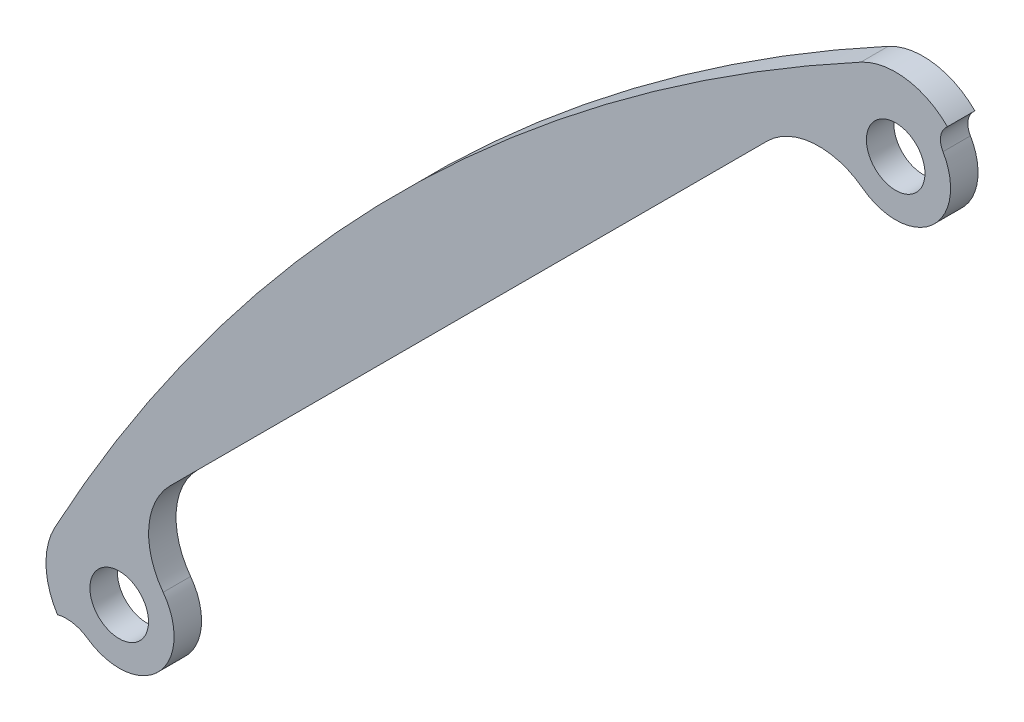
ISO-10303-21;
HEADER;
FILE_DESCRIPTION(('STEP AP214'),'2;1');
FILE_NAME('part.step','',(''),(''),'','','');
FILE_SCHEMA(('AUTOMOTIVE_DESIGN { 1 0 10303 214 1 1 1 1 }'));
ENDSEC;
DATA;
#1=APPLICATION_CONTEXT('core data for automotive mechanical design processes');
#2=APPLICATION_PROTOCOL_DEFINITION('international standard','automotive_design',2000,#1);
#3=PRODUCT_CONTEXT('',#1,'mechanical');
#4=PRODUCT('Part','Part','',(#3));
#5=PRODUCT_RELATED_PRODUCT_CATEGORY('part','',(#4));
#6=PRODUCT_DEFINITION_FORMATION('','',#4);
#7=PRODUCT_DEFINITION_CONTEXT('part definition',#1,'design');
#8=PRODUCT_DEFINITION('design','',#6,#7);
#9=PRODUCT_DEFINITION_SHAPE('','',#8);
#10=(LENGTH_UNIT() NAMED_UNIT(*) SI_UNIT(.MILLI.,.METRE.));
#11=(NAMED_UNIT(*) PLANE_ANGLE_UNIT() SI_UNIT($,.RADIAN.));
#12=(NAMED_UNIT(*) SI_UNIT($,.STERADIAN.) SOLID_ANGLE_UNIT());
#13=UNCERTAINTY_MEASURE_WITH_UNIT(LENGTH_MEASURE(1.E-05),#10,'distance_accuracy_value','');
#14=(GEOMETRIC_REPRESENTATION_CONTEXT(3) GLOBAL_UNCERTAINTY_ASSIGNED_CONTEXT((#13)) GLOBAL_UNIT_ASSIGNED_CONTEXT((#10,
#11,#12)) REPRESENTATION_CONTEXT('',''));
#15=CARTESIAN_POINT('',(0.,0.,0.));
#16=DIRECTION('',(0.,0.,1.));
#17=DIRECTION('',(1.,0.,0.));
#18=AXIS2_PLACEMENT_3D('',#15,#16,#17);
#19=CARTESIAN_POINT('',(-49.9380439181931,92.3644507894832,1.5));
#20=DIRECTION('',(0.,0.,-1.));
#21=DIRECTION('',(-1.,0.,0.));
#22=AXIS2_PLACEMENT_3D('',#19,#20,#21);
#23=CYLINDRICAL_SURFACE('',#22,4.);
#24=DIRECTION('',(0.,0.,-1.));
#25=VECTOR('',#24,1.);
#26=CARTESIAN_POINT('',(-51.8404455912932,95.8830965339181,6.5));
#27=LINE('',#26,#25);
#28=CARTESIAN_POINT('',(-51.8404455912549,95.8830965338473,3.));
#29=VERTEX_POINT('',#28);
#30=CARTESIAN_POINT('',(-51.840445591251,95.88309653384,1.5));
#31=VERTEX_POINT('',#30);
#32=EDGE_CURVE('E233',#29,#31,#27,.T.);
#33=ORIENTED_EDGE('',*,*,#32,.F.);
#34=CARTESIAN_POINT('',(-49.9380439181931,92.3644507894832,3.));
#35=DIRECTION('',(0.,0.,1.));
#36=DIRECTION('',(1.,0.,0.));
#37=AXIS2_PLACEMENT_3D('',#34,#35,#36);
#38=CIRCLE('',#37,4.);
#39=CARTESIAN_POINT('',(-47.1096167933636,95.1928779142894,3.));
#40=VERTEX_POINT('',#39);
#41=EDGE_CURVE('E274',#29,#40,#38,.F.);
#42=ORIENTED_EDGE('',*,*,#41,.T.);
#43=DIRECTION('',(0.,0.,1.));
#44=VECTOR('',#43,1.);
#45=CARTESIAN_POINT('',(-47.1096167933636,95.1928779142894,1.5));
#46=LINE('',#45,#44);
#47=CARTESIAN_POINT('',(-47.1096167934353,95.1928779142177,1.5));
#48=VERTEX_POINT('',#47);
#49=EDGE_CURVE('E238',#48,#40,#46,.T.);
#50=ORIENTED_EDGE('',*,*,#49,.F.);
#51=CARTESIAN_POINT('',(-49.9380439181931,92.3644507894832,1.5));
#52=DIRECTION('',(0.,0.,-1.));
#53=DIRECTION('',(-1.,0.,0.));
#54=AXIS2_PLACEMENT_3D('',#51,#52,#53);
#55=CIRCLE('',#54,4.);
#56=EDGE_CURVE('E254',#48,#31,#55,.F.);
#57=ORIENTED_EDGE('',*,*,#56,.T.);
#58=EDGE_LOOP('',(#33,#42,#50,#57));
#59=FACE_BOUND('',#58,.T.);
#60=ADVANCED_FACE('F101',(#59),#23,.T.);
#61=CARTESIAN_POINT('',(4.84334794492725E-12,9.20178907339733E-11,1.5));
#62=DIRECTION('',(0.,0.,-1.));
#63=DIRECTION('',(-1.,0.,0.));
#64=AXIS2_PLACEMENT_3D('',#61,#62,#63);
#65=CYLINDRICAL_SURFACE('',#64,109.);
#66=DIRECTION('',(0.,0.,1.));
#67=VECTOR('',#66,1.);
#68=CARTESIAN_POINT('',(-95.8830965339179,51.8404455912935,-3.5));
#69=LINE('',#68,#67);
#70=CARTESIAN_POINT('',(-95.8830965339179,51.8404455912935,1.5));
#71=VERTEX_POINT('',#70);
#72=CARTESIAN_POINT('',(-95.8830965338054,51.8404455912327,3.));
#73=VERTEX_POINT('',#72);
#74=EDGE_CURVE('E214',#71,#73,#69,.T.);
#75=ORIENTED_EDGE('',*,*,#74,.T.);
#76=CARTESIAN_POINT('',(4.84334794492725E-12,9.20178907339733E-11,3.));
#77=DIRECTION('',(0.,0.,1.));
#78=DIRECTION('',(1.,0.,0.));
#79=AXIS2_PLACEMENT_3D('',#76,#77,#78);
#80=CIRCLE('',#79,109.);
#81=EDGE_CURVE('E269',#73,#29,#80,.F.);
#82=ORIENTED_EDGE('',*,*,#81,.T.);
#83=ORIENTED_EDGE('',*,*,#32,.T.);
#84=CARTESIAN_POINT('',(0.,0.,1.5));
#85=DIRECTION('',(0.,0.,1.));
#86=DIRECTION('',(1.,0.,0.));
#87=AXIS2_PLACEMENT_3D('',#84,#85,#86);
#88=CIRCLE('',#87,109.000000000167);
#89=EDGE_CURVE('E235',#31,#71,#88,.T.);
#90=ORIENTED_EDGE('',*,*,#89,.T.);
#91=EDGE_LOOP('',(#75,#82,#83,#90));
#92=FACE_BOUND('',#91,.T.);
#93=ADVANCED_FACE('F302',(#92),#65,.T.);
#94=CARTESIAN_POINT('',(-49.9380439181764,92.3644507894767,0.));
#95=DIRECTION('',(0.,0.,1.));
#96=DIRECTION('',(1.,0.,0.));
#97=AXIS2_PLACEMENT_3D('',#94,#95,#96);
#98=CYLINDRICAL_SURFACE('',#97,1.6);
#99=CARTESIAN_POINT('',(-49.9380439181764,92.3644507894767,1.5));
#100=DIRECTION('',(0.,0.,-1.));
#101=DIRECTION('',(-1.,0.,0.));
#102=AXIS2_PLACEMENT_3D('',#99,#100,#101);
#103=CIRCLE('',#102,1.6);
#104=CARTESIAN_POINT('',(-51.5380439181764,92.3644507894767,1.5));
#105=VERTEX_POINT('',#104);
#106=EDGE_CURVE('E242',#105,#105,#103,.F.);
#107=ORIENTED_EDGE('',*,*,#106,.F.);
#108=EDGE_LOOP('',(#107));
#109=FACE_BOUND('',#108,.T.);
#110=CARTESIAN_POINT('',(-49.9380439181764,92.3644507894767,3.));
#111=DIRECTION('',(0.,0.,1.));
#112=DIRECTION('',(1.,0.,0.));
#113=AXIS2_PLACEMENT_3D('',#110,#111,#112);
#114=CIRCLE('',#113,1.6);
#115=CARTESIAN_POINT('',(-48.3380439181764,92.3644507894767,3.));
#116=VERTEX_POINT('',#115);
#117=EDGE_CURVE('E215',#116,#116,#114,.F.);
#118=ORIENTED_EDGE('',*,*,#117,.F.);
#119=EDGE_LOOP('',(#118));
#120=FACE_BOUND('',#119,.T.);
#121=ADVANCED_FACE('F330',(#109,#120),#98,.F.);
#122=CARTESIAN_POINT('',(-92.3644507894765,49.9380439181767,0.));
#123=DIRECTION('',(0.,0.,1.));
#124=DIRECTION('',(1.,0.,0.));
#125=AXIS2_PLACEMENT_3D('',#122,#123,#124);
#126=CYLINDRICAL_SURFACE('',#125,1.59999999999998);
#127=CARTESIAN_POINT('',(-92.3644507894765,49.9380439181767,1.5));
#128=DIRECTION('',(0.,0.,-1.));
#129=DIRECTION('',(-1.,0.,0.));
#130=AXIS2_PLACEMENT_3D('',#127,#128,#129);
#131=CIRCLE('',#130,1.59999999999998);
#132=CARTESIAN_POINT('',(-93.9644507894765,49.9380439181767,1.5));
#133=VERTEX_POINT('',#132);
#134=EDGE_CURVE('E251',#133,#133,#131,.F.);
#135=ORIENTED_EDGE('',*,*,#134,.F.);
#136=EDGE_LOOP('',(#135));
#137=FACE_BOUND('',#136,.T.);
#138=CARTESIAN_POINT('',(-92.3644507894765,49.9380439181767,3.));
#139=DIRECTION('',(0.,0.,1.));
#140=DIRECTION('',(1.,0.,0.));
#141=AXIS2_PLACEMENT_3D('',#138,#139,#140);
#142=CIRCLE('',#141,1.59999999999998);
#143=CARTESIAN_POINT('',(-90.7644507894766,49.9380439181767,3.));
#144=VERTEX_POINT('',#143);
#145=EDGE_CURVE('E264',#144,#144,#142,.F.);
#146=ORIENTED_EDGE('',*,*,#145,.F.);
#147=EDGE_LOOP('',(#146));
#148=FACE_BOUND('',#147,.T.);
#149=ADVANCED_FACE('F350',(#137,#148),#126,.F.);
#150=CARTESIAN_POINT('',(-92.3644507894765,49.9380439181767,1.5));
#151=DIRECTION('',(0.,0.,1.));
#152=DIRECTION('',(1.,0.,0.));
#153=AXIS2_PLACEMENT_3D('',#150,#151,#152);
#154=CYLINDRICAL_SURFACE('',#153,3.00000000000003);
#155=CARTESIAN_POINT('',(-92.3644507894765,49.9380439181767,3.));
#156=DIRECTION('',(0.,0.,1.));
#157=DIRECTION('',(1.,0.,0.));
#158=AXIS2_PLACEMENT_3D('',#155,#156,#157);
#159=CIRCLE('',#158,3.00000000000003);
#160=CARTESIAN_POINT('',(-94.0905838642911,47.4843804106778,3.));
#161=VERTEX_POINT('',#160);
#162=CARTESIAN_POINT('',(-89.9618423894396,51.7345607914823,3.));
#163=VERTEX_POINT('',#162);
#164=EDGE_CURVE('E277',#161,#163,#159,.T.);
#165=ORIENTED_EDGE('',*,*,#164,.F.);
#166=DIRECTION('',(0.,0.,1.));
#167=VECTOR('',#166,1.);
#168=CARTESIAN_POINT('',(-94.0905838642911,47.4843804106778,1.5));
#169=LINE('',#168,#167);
#170=CARTESIAN_POINT('',(-94.0905838642911,47.4843804106778,1.5));
#171=VERTEX_POINT('',#170);
#172=EDGE_CURVE('E224',#161,#171,#169,.F.);
#173=ORIENTED_EDGE('',*,*,#172,.T.);
#174=CARTESIAN_POINT('',(-92.3644507894765,49.9380439181767,1.5));
#175=DIRECTION('',(0.,0.,-1.));
#176=DIRECTION('',(-1.,0.,0.));
#177=AXIS2_PLACEMENT_3D('',#174,#175,#176);
#178=CIRCLE('',#177,3.00000000000003);
#179=CARTESIAN_POINT('',(-89.9618423894396,51.7345607914823,1.5));
#180=VERTEX_POINT('',#179);
#181=EDGE_CURVE('E239',#180,#171,#178,.T.);
#182=ORIENTED_EDGE('',*,*,#181,.F.);
#183=DIRECTION('',(0.,0.,1.));
#184=VECTOR('',#183,1.);
#185=CARTESIAN_POINT('',(-89.9618423894396,51.7345607914823,1.5));
#186=LINE('',#185,#184);
#187=EDGE_CURVE('E217',#180,#163,#186,.T.);
#188=ORIENTED_EDGE('',*,*,#187,.T.);
#189=EDGE_LOOP('',(#165,#173,#182,#188));
#190=FACE_BOUND('',#189,.T.);
#191=ADVANCED_FACE('F292',(#190),#154,.T.);
#192=CARTESIAN_POINT('',(-49.9380439181764,92.3644507894767,1.5));
#193=DIRECTION('',(0.,0.,1.));
#194=DIRECTION('',(1.,0.,0.));
#195=AXIS2_PLACEMENT_3D('',#192,#193,#194);
#196=CYLINDRICAL_SURFACE('',#195,3.);
#197=CARTESIAN_POINT('',(-49.9380439181764,92.3644507894767,3.));
#198=DIRECTION('',(0.,0.,1.));
#199=DIRECTION('',(1.,0.,0.));
#200=AXIS2_PLACEMENT_3D('',#197,#198,#199);
#201=CIRCLE('',#200,3.);
#202=CARTESIAN_POINT('',(-51.734560791482,89.9618423894398,3.));
#203=VERTEX_POINT('',#202);
#204=CARTESIAN_POINT('',(-47.3537542416421,93.8880802942312,3.));
#205=VERTEX_POINT('',#204);
#206=EDGE_CURVE('E184',#203,#205,#201,.T.);
#207=ORIENTED_EDGE('',*,*,#206,.F.);
#208=DIRECTION('',(0.,0.,1.));
#209=VECTOR('',#208,1.);
#210=CARTESIAN_POINT('',(-51.734560791482,89.9618423894398,1.5));
#211=LINE('',#210,#209);
#212=CARTESIAN_POINT('',(-51.734560791482,89.9618423894398,1.5));
#213=VERTEX_POINT('',#212);
#214=EDGE_CURVE('E123',#203,#213,#211,.F.);
#215=ORIENTED_EDGE('',*,*,#214,.T.);
#216=CARTESIAN_POINT('',(-49.9380439181764,92.3644507894767,1.5));
#217=DIRECTION('',(0.,0.,-1.));
#218=DIRECTION('',(-1.,0.,0.));
#219=AXIS2_PLACEMENT_3D('',#216,#217,#218);
#220=CIRCLE('',#219,3.);
#221=CARTESIAN_POINT('',(-47.3537542416421,93.8880802942312,1.5));
#222=VERTEX_POINT('',#221);
#223=EDGE_CURVE('E210',#222,#213,#220,.T.);
#224=ORIENTED_EDGE('',*,*,#223,.F.);
#225=DIRECTION('',(0.,0.,1.));
#226=VECTOR('',#225,1.);
#227=CARTESIAN_POINT('',(-47.3537542416421,93.8880802942312,1.5));
#228=LINE('',#227,#226);
#229=EDGE_CURVE('E192',#222,#205,#228,.T.);
#230=ORIENTED_EDGE('',*,*,#229,.T.);
#231=EDGE_LOOP('',(#207,#215,#224,#230));
#232=FACE_BOUND('',#231,.T.);
#233=ADVANCED_FACE('F190',(#232),#196,.T.);
#234=CARTESIAN_POINT('',(-47.8167235746167,94.4857711330363,1.5));
#235=DIRECTION('',(-0.707106781186537,0.707106781186558,0.));
#236=DIRECTION('',(-0.707106781186558,-0.707106781186537,0.));
#237=AXIS2_PLACEMENT_3D('',#234,#235,#236);
#238=PLANE('',#237);
#239=DIRECTION('',(0.707106781186558,0.707106781186537,0.));
#240=VECTOR('',#239,1.);
#241=CARTESIAN_POINT('',(-47.8167235746167,94.4857711330363,3.));
#242=LINE('',#241,#240);
#243=CARTESIAN_POINT('',(-47.1994311306505,95.1030635770025,3.));
#244=VERTEX_POINT('',#243);
#245=EDGE_CURVE('E279',#244,#40,#242,.T.);
#246=ORIENTED_EDGE('',*,*,#245,.F.);
#247=DIRECTION('',(0.,0.,-1.));
#248=VECTOR('',#247,1.);
#249=CARTESIAN_POINT('',(-47.1994311306505,95.1030635770025,1.5));
#250=LINE('',#249,#248);
#251=CARTESIAN_POINT('',(-47.1994311306505,95.1030635770025,1.5));
#252=VERTEX_POINT('',#251);
#253=EDGE_CURVE('E228',#244,#252,#250,.T.);
#254=ORIENTED_EDGE('',*,*,#253,.T.);
#255=DIRECTION('',(-0.707106781186558,-0.707106781186537,0.));
#256=VECTOR('',#255,1.);
#257=CARTESIAN_POINT('',(-47.8167235746167,94.4857711330363,1.5));
#258=LINE('',#257,#256);
#259=EDGE_CURVE('E245',#48,#252,#258,.T.);
#260=ORIENTED_EDGE('',*,*,#259,.F.);
#261=ORIENTED_EDGE('',*,*,#49,.T.);
#262=EDGE_LOOP('',(#246,#254,#260,#261));
#263=FACE_BOUND('',#262,.T.);
#264=ADVANCED_FACE('F310',(#263),#238,.F.);
#265=CARTESIAN_POINT('',(-46.4923243494639,94.395956795816,1.5));
#266=DIRECTION('',(0.,0.,1.));
#267=DIRECTION('',(1.,0.,0.));
#268=AXIS2_PLACEMENT_3D('',#265,#266,#267);
#269=CYLINDRICAL_SURFACE('',#268,1.);
#270=CARTESIAN_POINT('',(-46.4923243494639,94.395956795816,3.));
#271=DIRECTION('',(0.,0.,1.));
#272=DIRECTION('',(1.,0.,0.));
#273=AXIS2_PLACEMENT_3D('',#270,#271,#272);
#274=CIRCLE('',#273,1.);
#275=EDGE_CURVE('E281',#205,#244,#274,.F.);
#276=ORIENTED_EDGE('',*,*,#275,.F.);
#277=ORIENTED_EDGE('',*,*,#229,.F.);
#278=CARTESIAN_POINT('',(-46.4923243494639,94.395956795816,1.5));
#279=DIRECTION('',(0.,0.,1.));
#280=DIRECTION('',(1.,0.,0.));
#281=AXIS2_PLACEMENT_3D('',#278,#279,#280);
#282=CIRCLE('',#281,1.);
#283=EDGE_CURVE('E226',#252,#222,#282,.T.);
#284=ORIENTED_EDGE('',*,*,#283,.F.);
#285=ORIENTED_EDGE('',*,*,#253,.F.);
#286=EDGE_LOOP('',(#276,#277,#284,#285));
#287=FACE_BOUND('',#286,.T.);
#288=ADVANCED_FACE('F313',(#287),#269,.F.);
#289=CARTESIAN_POINT('',(-95.2413392475008,45.848604739012,1.5));
#290=DIRECTION('',(0.,0.,-1.));
#291=DIRECTION('',(-1.,0.,0.));
#292=AXIS2_PLACEMENT_3D('',#289,#290,#291);
#293=CYLINDRICAL_SURFACE('',#292,2.);
#294=CARTESIAN_POINT('',(-95.2413392475008,45.848604739012,3.));
#295=DIRECTION('',(0.,0.,1.));
#296=DIRECTION('',(1.,0.,0.));
#297=AXIS2_PLACEMENT_3D('',#294,#295,#296);
#298=CIRCLE('',#297,2.);
#299=CARTESIAN_POINT('',(-95.7364301373982,47.7863573059669,3.));
#300=VERTEX_POINT('',#299);
#301=EDGE_CURVE('E272',#300,#161,#298,.F.);
#302=ORIENTED_EDGE('',*,*,#301,.F.);
#303=DIRECTION('',(0.,0.,-1.));
#304=VECTOR('',#303,1.);
#305=CARTESIAN_POINT('',(-95.7364301374243,47.7863573057409,6.5));
#306=LINE('',#305,#304);
#307=CARTESIAN_POINT('',(-95.7364301372988,47.7863573059923,1.5));
#308=VERTEX_POINT('',#307);
#309=EDGE_CURVE('E231',#300,#308,#306,.T.);
#310=ORIENTED_EDGE('',*,*,#309,.T.);
#311=CARTESIAN_POINT('',(-95.2413392475008,45.848604739012,1.5));
#312=DIRECTION('',(0.,0.,1.));
#313=DIRECTION('',(1.,0.,0.));
#314=AXIS2_PLACEMENT_3D('',#311,#312,#313);
#315=CIRCLE('',#314,2.);
#316=EDGE_CURVE('E219',#171,#308,#315,.T.);
#317=ORIENTED_EDGE('',*,*,#316,.F.);
#318=ORIENTED_EDGE('',*,*,#172,.F.);
#319=EDGE_LOOP('',(#302,#310,#317,#318));
#320=FACE_BOUND('',#319,.T.);
#321=ADVANCED_FACE('F296',(#320),#293,.F.);
#322=CARTESIAN_POINT('',(-92.3644507894765,49.9380439181767,-3.5));
#323=DIRECTION('',(0.,0.,1.));
#324=DIRECTION('',(1.,0.,0.));
#325=AXIS2_PLACEMENT_3D('',#322,#323,#324);
#326=CYLINDRICAL_SURFACE('',#325,4.00000000009412);
#327=CARTESIAN_POINT('',(-92.3644507894765,49.9380439181767,3.));
#328=DIRECTION('',(0.,0.,1.));
#329=DIRECTION('',(1.,0.,0.));
#330=AXIS2_PLACEMENT_3D('',#327,#328,#329);
#331=CIRCLE('',#330,4.00000000009412);
#332=EDGE_CURVE('E267',#73,#300,#331,.T.);
#333=ORIENTED_EDGE('',*,*,#332,.F.);
#334=ORIENTED_EDGE('',*,*,#74,.F.);
#335=CARTESIAN_POINT('',(-92.3644507894765,49.9380439181767,1.5));
#336=DIRECTION('',(0.,0.,1.));
#337=DIRECTION('',(1.,0.,0.));
#338=AXIS2_PLACEMENT_3D('',#335,#336,#337);
#339=CIRCLE('',#338,4.00000000009412);
#340=EDGE_CURVE('E257',#308,#71,#339,.F.);
#341=ORIENTED_EDGE('',*,*,#340,.F.);
#342=ORIENTED_EDGE('',*,*,#309,.F.);
#343=EDGE_LOOP('',(#333,#334,#341,#342));
#344=FACE_BOUND('',#343,.T.);
#345=ADVANCED_FACE('F315',(#344),#326,.T.);
#346=CARTESIAN_POINT('',(-52.059364261736,94.4857711330364,-3.5));
#347=DIRECTION('',(-0.707106781186546,0.707106781186549,0.));
#348=DIRECTION('',(-0.707106781186549,-0.707106781186546,0.));
#349=AXIS2_PLACEMENT_3D('',#346,#347,#348);
#350=PLANE('',#349);
#351=DIRECTION('',(0.707106781186549,0.707106781186546,0.));
#352=VECTOR('',#351,1.);
#353=CARTESIAN_POINT('',(-52.059364261736,94.4857711330364,3.));
#354=LINE('',#353,#352);
#355=CARTESIAN_POINT('',(-89.5867916474698,56.9583437473027,3.));
#356=VERTEX_POINT('',#355);
#357=CARTESIAN_POINT('',(-56.9583437473024,89.58679164747,3.));
#358=VERTEX_POINT('',#357);
#359=EDGE_CURVE('E115',#356,#358,#354,.T.);
#360=ORIENTED_EDGE('',*,*,#359,.F.);
#361=DIRECTION('',(0.,0.,-1.));
#362=VECTOR('',#361,1.);
#363=CARTESIAN_POINT('',(-89.5867916474698,56.9583437473027,1.5));
#364=LINE('',#363,#362);
#365=CARTESIAN_POINT('',(-89.5867916474698,56.9583437473027,1.5));
#366=VERTEX_POINT('',#365);
#367=EDGE_CURVE('E197',#356,#366,#364,.T.);
#368=ORIENTED_EDGE('',*,*,#367,.T.);
#369=DIRECTION('',(-0.707106781186549,-0.707106781186546,0.));
#370=VECTOR('',#369,1.);
#371=CARTESIAN_POINT('',(-108.848191374299,37.6969440204731,1.5));
#372=LINE('',#371,#370);
#373=CARTESIAN_POINT('',(-56.9583437473024,89.5867916474701,1.5));
#374=VERTEX_POINT('',#373);
#375=EDGE_CURVE('E208',#374,#366,#372,.T.);
#376=ORIENTED_EDGE('',*,*,#375,.F.);
#377=DIRECTION('',(0.,0.,-1.));
#378=VECTOR('',#377,1.);
#379=CARTESIAN_POINT('',(-56.9583437473024,89.58679164747,6.5));
#380=LINE('',#379,#378);
#381=EDGE_CURVE('E200',#374,#358,#380,.F.);
#382=ORIENTED_EDGE('',*,*,#381,.T.);
#383=EDGE_LOOP('',(#360,#368,#376,#382));
#384=FACE_BOUND('',#383,.T.);
#385=ADVANCED_FACE('F212',(#384),#350,.F.);
#386=CARTESIAN_POINT('',(-86.7583645227236,54.1299166225565,1.5));
#387=DIRECTION('',(0.,0.,1.));
#388=DIRECTION('',(1.,0.,0.));
#389=AXIS2_PLACEMENT_3D('',#386,#387,#388);
#390=CYLINDRICAL_SURFACE('',#389,4.);
#391=CARTESIAN_POINT('',(-86.7583645227236,54.1299166225565,3.));
#392=DIRECTION('',(0.,0.,1.));
#393=DIRECTION('',(1.,0.,0.));
#394=AXIS2_PLACEMENT_3D('',#391,#392,#393);
#395=CIRCLE('',#394,4.);
#396=EDGE_CURVE('E193',#163,#356,#395,.F.);
#397=ORIENTED_EDGE('',*,*,#396,.F.);
#398=ORIENTED_EDGE('',*,*,#187,.F.);
#399=CARTESIAN_POINT('',(-86.7583645227236,54.1299166225565,1.5));
#400=DIRECTION('',(0.,0.,1.));
#401=DIRECTION('',(1.,0.,0.));
#402=AXIS2_PLACEMENT_3D('',#399,#400,#401);
#403=CIRCLE('',#402,4.);
#404=EDGE_CURVE('E196',#366,#180,#403,.T.);
#405=ORIENTED_EDGE('',*,*,#404,.F.);
#406=ORIENTED_EDGE('',*,*,#367,.F.);
#407=EDGE_LOOP('',(#397,#398,#405,#406));
#408=FACE_BOUND('',#407,.T.);
#409=ADVANCED_FACE('F288',(#408),#390,.F.);
#410=CARTESIAN_POINT('',(-54.1299166225562,86.7583645227238,1.5));
#411=DIRECTION('',(0.,0.,1.));
#412=DIRECTION('',(1.,0.,0.));
#413=AXIS2_PLACEMENT_3D('',#410,#411,#412);
#414=CYLINDRICAL_SURFACE('',#413,4.);
#415=CARTESIAN_POINT('',(-54.1299166225562,86.7583645227238,3.));
#416=DIRECTION('',(0.,0.,1.));
#417=DIRECTION('',(1.,0.,0.));
#418=AXIS2_PLACEMENT_3D('',#415,#416,#417);
#419=CIRCLE('',#418,4.);
#420=EDGE_CURVE('E12',#358,#203,#419,.F.);
#421=ORIENTED_EDGE('',*,*,#420,.F.);
#422=ORIENTED_EDGE('',*,*,#381,.F.);
#423=CARTESIAN_POINT('',(-54.1299166225562,86.7583645227238,1.5));
#424=DIRECTION('',(0.,0.,1.));
#425=DIRECTION('',(1.,0.,0.));
#426=AXIS2_PLACEMENT_3D('',#423,#424,#425);
#427=CIRCLE('',#426,4.);
#428=EDGE_CURVE('E109',#213,#374,#427,.T.);
#429=ORIENTED_EDGE('',*,*,#428,.F.);
#430=ORIENTED_EDGE('',*,*,#214,.F.);
#431=EDGE_LOOP('',(#421,#422,#429,#430));
#432=FACE_BOUND('',#431,.T.);
#433=ADVANCED_FACE('F103',(#432),#414,.F.);
#434=CARTESIAN_POINT('',(-46.1822253947383,-24.9690219590883,1.5));
#435=DIRECTION('',(0.,0.,1.));
#436=DIRECTION('',(1.,0.,0.));
#437=AXIS2_PLACEMENT_3D('',#434,#435,#436);
#438=PLANE('',#437);
#439=ORIENTED_EDGE('',*,*,#223,.T.);
#440=ORIENTED_EDGE('',*,*,#428,.T.);
#441=ORIENTED_EDGE('',*,*,#375,.T.);
#442=ORIENTED_EDGE('',*,*,#404,.T.);
#443=ORIENTED_EDGE('',*,*,#181,.T.);
#444=ORIENTED_EDGE('',*,*,#316,.T.);
#445=ORIENTED_EDGE('',*,*,#340,.T.);
#446=ORIENTED_EDGE('',*,*,#89,.F.);
#447=ORIENTED_EDGE('',*,*,#56,.F.);
#448=ORIENTED_EDGE('',*,*,#259,.T.);
#449=ORIENTED_EDGE('',*,*,#283,.T.);
#450=EDGE_LOOP('',(#439,#440,#441,#442,#443,#444,#445,#446,#447,#448,#449));
#451=FACE_BOUND('',#450,.T.);
#452=ORIENTED_EDGE('',*,*,#134,.T.);
#453=EDGE_LOOP('',(#452));
#454=FACE_BOUND('',#453,.T.);
#455=ORIENTED_EDGE('',*,*,#106,.T.);
#456=EDGE_LOOP('',(#455));
#457=FACE_BOUND('',#456,.T.);
#458=ADVANCED_FACE('F206',(#451,#454,#457),#438,.F.);
#459=CARTESIAN_POINT('',(0.,0.,3.));
#460=DIRECTION('',(0.,0.,1.));
#461=DIRECTION('',(1.,0.,0.));
#462=AXIS2_PLACEMENT_3D('',#459,#460,#461);
#463=PLANE('',#462);
#464=ORIENTED_EDGE('',*,*,#332,.T.);
#465=ORIENTED_EDGE('',*,*,#301,.T.);
#466=ORIENTED_EDGE('',*,*,#164,.T.);
#467=ORIENTED_EDGE('',*,*,#396,.T.);
#468=ORIENTED_EDGE('',*,*,#359,.T.);
#469=ORIENTED_EDGE('',*,*,#420,.T.);
#470=ORIENTED_EDGE('',*,*,#206,.T.);
#471=ORIENTED_EDGE('',*,*,#275,.T.);
#472=ORIENTED_EDGE('',*,*,#245,.T.);
#473=ORIENTED_EDGE('',*,*,#41,.F.);
#474=ORIENTED_EDGE('',*,*,#81,.F.);
#475=EDGE_LOOP('',(#464,#465,#466,#467,#468,#469,#470,#471,#472,#473,#474));
#476=FACE_BOUND('',#475,.T.);
#477=ORIENTED_EDGE('',*,*,#145,.T.);
#478=EDGE_LOOP('',(#477));
#479=FACE_BOUND('',#478,.T.);
#480=ORIENTED_EDGE('',*,*,#117,.T.);
#481=EDGE_LOOP('',(#480));
#482=FACE_BOUND('',#481,.T.);
#483=ADVANCED_FACE('F182',(#476,#479,#482),#463,.T.);
#484=CLOSED_SHELL('',(#60,#93,#121,#149,#191,#233,#264,#288,#321,#345,#385,#409,#433,#458,#483));
#485=MANIFOLD_SOLID_BREP('B2',#484);
#486=ADVANCED_BREP_SHAPE_REPRESENTATION('',(#18,#485),#14);
#487=SHAPE_DEFINITION_REPRESENTATION(#9,#486);
ENDSEC;
END-ISO-10303-21;
